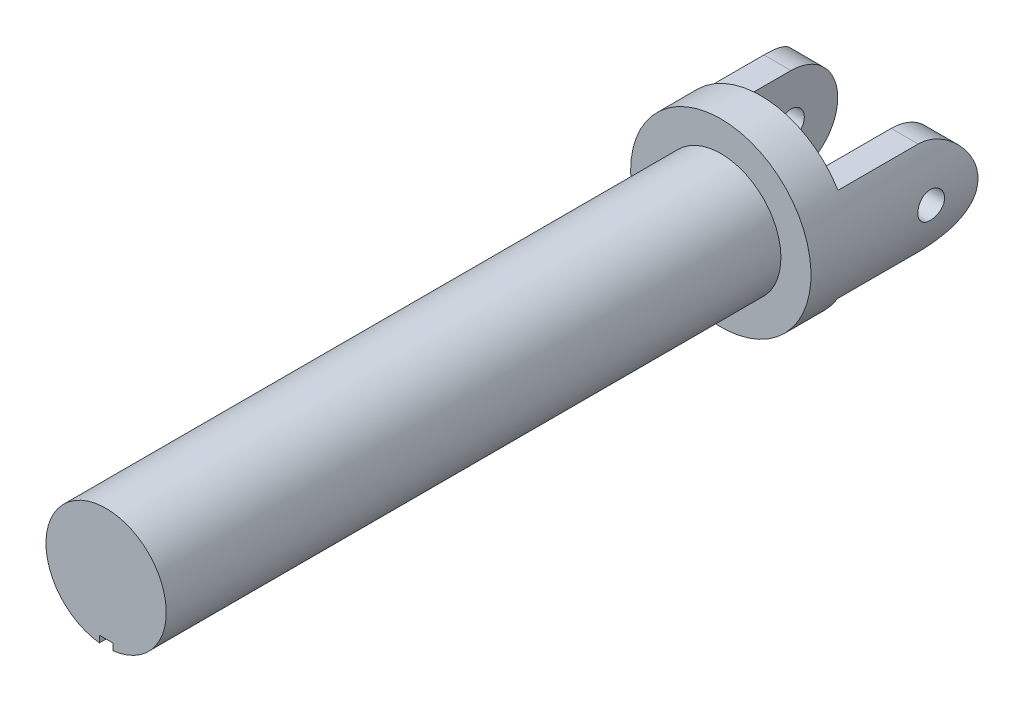
ISO-10303-21;
HEADER;
FILE_DESCRIPTION(('STEP AP214'),'2;1');
FILE_NAME('part.step','',(''),(''),'','','');
FILE_SCHEMA(('AUTOMOTIVE_DESIGN { 1 0 10303 214 1 1 1 1 }'));
ENDSEC;
DATA;
#1=APPLICATION_CONTEXT('core data for automotive mechanical design processes');
#2=APPLICATION_PROTOCOL_DEFINITION('international standard','automotive_design',2000,#1);
#3=PRODUCT_CONTEXT('',#1,'mechanical');
#4=PRODUCT('Part','Part','',(#3));
#5=PRODUCT_RELATED_PRODUCT_CATEGORY('part','',(#4));
#6=PRODUCT_DEFINITION_FORMATION('','',#4);
#7=PRODUCT_DEFINITION_CONTEXT('part definition',#1,'design');
#8=PRODUCT_DEFINITION('design','',#6,#7);
#9=PRODUCT_DEFINITION_SHAPE('','',#8);
#10=(LENGTH_UNIT() NAMED_UNIT(*) SI_UNIT(.MILLI.,.METRE.));
#11=(NAMED_UNIT(*) PLANE_ANGLE_UNIT() SI_UNIT($,.RADIAN.));
#12=(NAMED_UNIT(*) SI_UNIT($,.STERADIAN.) SOLID_ANGLE_UNIT());
#13=UNCERTAINTY_MEASURE_WITH_UNIT(LENGTH_MEASURE(1.E-05),#10,'distance_accuracy_value','');
#14=(GEOMETRIC_REPRESENTATION_CONTEXT(3) GLOBAL_UNCERTAINTY_ASSIGNED_CONTEXT((#13)) GLOBAL_UNIT_ASSIGNED_CONTEXT((#10,
#11,#12)) REPRESENTATION_CONTEXT('',''));
#15=CARTESIAN_POINT('',(0.,0.,0.));
#16=DIRECTION('',(0.,0.,1.));
#17=DIRECTION('',(1.,0.,0.));
#18=AXIS2_PLACEMENT_3D('',#15,#16,#17);
#19=CARTESIAN_POINT('',(0.,0.,23.));
#20=DIRECTION('',(0.,0.,-1.));
#21=DIRECTION('',(-1.,0.,0.));
#22=AXIS2_PLACEMENT_3D('',#19,#20,#21);
#23=CYLINDRICAL_SURFACE('',#22,4.5);
#24=DIRECTION('',(0.,0.,-1.));
#25=VECTOR('',#24,1.);
#26=CARTESIAN_POINT('',(-0.5,-4.47213595499958,23.));
#27=LINE('',#26,#25);
#28=CARTESIAN_POINT('',(-0.5,-4.47213595499958,23.));
#29=VERTEX_POINT('',#28);
#30=CARTESIAN_POINT('',(-0.5,-4.47213595499958,-23.));
#31=VERTEX_POINT('',#30);
#32=EDGE_CURVE('E167',#29,#31,#27,.T.);
#33=ORIENTED_EDGE('',*,*,#32,.F.);
#34=CARTESIAN_POINT('',(0.,0.,23.));
#35=DIRECTION('',(0.,0.,1.));
#36=DIRECTION('',(1.,0.,0.));
#37=AXIS2_PLACEMENT_3D('',#34,#35,#36);
#38=CIRCLE('',#37,4.5);
#39=CARTESIAN_POINT('',(0.5,-4.47213595499958,23.));
#40=VERTEX_POINT('',#39);
#41=EDGE_CURVE('E12',#40,#29,#38,.T.);
#42=ORIENTED_EDGE('',*,*,#41,.F.);
#43=DIRECTION('',(0.,0.,-1.));
#44=VECTOR('',#43,1.);
#45=CARTESIAN_POINT('',(0.5,-4.47213595499958,23.));
#46=LINE('',#45,#44);
#47=CARTESIAN_POINT('',(0.5,-4.47213595499958,-23.));
#48=VERTEX_POINT('',#47);
#49=EDGE_CURVE('E85',#48,#40,#46,.F.);
#50=ORIENTED_EDGE('',*,*,#49,.F.);
#51=CARTESIAN_POINT('',(0.,0.,-23.));
#52=DIRECTION('',(0.,0.,-1.));
#53=DIRECTION('',(-1.,0.,0.));
#54=AXIS2_PLACEMENT_3D('',#51,#52,#53);
#55=CIRCLE('',#54,4.5);
#56=EDGE_CURVE('E78',#31,#48,#55,.T.);
#57=ORIENTED_EDGE('',*,*,#56,.F.);
#58=EDGE_LOOP('',(#33,#42,#50,#57));
#59=FACE_BOUND('',#58,.T.);
#60=ADVANCED_FACE('F70',(#59),#23,.T.);
#61=CARTESIAN_POINT('',(0.,0.,23.));
#62=DIRECTION('',(0.,0.,1.));
#63=DIRECTION('',(1.,0.,0.));
#64=AXIS2_PLACEMENT_3D('',#61,#62,#63);
#65=PLANE('',#64);
#66=ORIENTED_EDGE('',*,*,#41,.T.);
#67=DIRECTION('',(0.,1.,0.));
#68=VECTOR('',#67,1.);
#69=CARTESIAN_POINT('',(-0.5,-4.47213595499958,23.));
#70=LINE('',#69,#68);
#71=CARTESIAN_POINT('',(-0.5,-3.97213595499958,23.));
#72=VERTEX_POINT('',#71);
#73=EDGE_CURVE('E190',#29,#72,#70,.T.);
#74=ORIENTED_EDGE('',*,*,#73,.T.);
#75=DIRECTION('',(1.,0.,0.));
#76=VECTOR('',#75,1.);
#77=CARTESIAN_POINT('',(-0.5,-3.97213595499958,23.));
#78=LINE('',#77,#76);
#79=CARTESIAN_POINT('',(0.5,-3.97213595499958,23.));
#80=VERTEX_POINT('',#79);
#81=EDGE_CURVE('E180',#72,#80,#78,.T.);
#82=ORIENTED_EDGE('',*,*,#81,.T.);
#83=DIRECTION('',(0.,-1.,0.));
#84=VECTOR('',#83,1.);
#85=CARTESIAN_POINT('',(0.5,-3.97213595499958,23.));
#86=LINE('',#85,#84);
#87=EDGE_CURVE('E193',#80,#40,#86,.T.);
#88=ORIENTED_EDGE('',*,*,#87,.T.);
#89=EDGE_LOOP('',(#66,#74,#82,#88));
#90=FACE_BOUND('',#89,.T.);
#91=ADVANCED_FACE('F289',(#90),#65,.T.);
#92=CARTESIAN_POINT('',(0.,0.,-26.));
#93=DIRECTION('',(0.,0.,1.));
#94=DIRECTION('',(1.,0.,0.));
#95=AXIS2_PLACEMENT_3D('',#92,#93,#94);
#96=CYLINDRICAL_SURFACE('',#95,6.75);
#97=CARTESIAN_POINT('',(-6.75,0.,-33.));
#98=CARTESIAN_POINT('',(-6.74999911272059,0.0558425409101658,-32.9999976909739));
#99=CARTESIAN_POINT('',(-6.74929975767196,0.111717684844449,-32.9953066262002));
#100=CARTESIAN_POINT('',(-6.74657719642042,0.221906738606191,-32.9766707451346));
#101=CARTESIAN_POINT('',(-6.74455269374564,0.276219065053058,-32.9627168662834));
#102=CARTESIAN_POINT('',(-6.73940739080019,0.381671836837063,-32.9259809826003));
#103=CARTESIAN_POINT('',(-6.73628741208205,0.432814625447508,-32.9032055921468));
#104=CARTESIAN_POINT('',(-6.72929609307386,0.53054453124302,-32.8494892287142));
#105=CARTESIAN_POINT('',(-6.72542485910577,0.577132291680518,-32.8185494109893));
#106=CARTESIAN_POINT('',(-6.71732864075089,0.664793017751606,-32.7491309350935));
#107=CARTESIAN_POINT('',(-6.71310142384377,0.705826205517568,-32.7106023010483));
#108=CARTESIAN_POINT('',(-6.70478718892022,0.780869855713777,-32.6272074094649));
#109=CARTESIAN_POINT('',(-6.70070017890102,0.814879918107204,-32.5823407911604));
#110=CARTESIAN_POINT('',(-6.69310742202681,0.875066235908758,-32.4872769283577));
#111=CARTESIAN_POINT('',(-6.6896045599627,0.901204098047277,-32.4370551261348));
#112=CARTESIAN_POINT('',(-6.68360711396162,0.944658716040227,-32.3328737482525));
#113=CARTESIAN_POINT('',(-6.68111247643255,0.961975940767676,-32.2789143714423));
#114=CARTESIAN_POINT('',(-6.67743583632494,0.987174376659303,-32.1692074990302));
#115=CARTESIAN_POINT('',(-6.67624437438597,0.99512362030846,-32.1134759525087));
#116=CARTESIAN_POINT('',(-6.67528025275461,1.00157118326889,-32.0014582086667));
#117=CARTESIAN_POINT('',(-6.67550751356993,1.00007003209414,-31.9451720425985));
#118=CARTESIAN_POINT('',(-6.67734650914669,0.987715034694436,-31.834122886774));
#119=CARTESIAN_POINT('',(-6.67894703709383,0.976936892914966,-31.7793512620758));
#120=CARTESIAN_POINT('',(-6.68333472365175,0.946452342629805,-31.6724025809788));
#121=CARTESIAN_POINT('',(-6.68612191507621,0.926745687231395,-31.6202255963716));
#122=CARTESIAN_POINT('',(-6.69258128775432,0.878884561850784,-31.5197165856181));
#123=CARTESIAN_POINT('',(-6.69625682457254,0.850697959155641,-31.4714000851476));
#124=CARTESIAN_POINT('',(-6.70407630948204,0.786699945498339,-31.3801539640613));
#125=CARTESIAN_POINT('',(-6.70822028756469,0.750888046206284,-31.3372246887274));
#126=CARTESIAN_POINT('',(-6.71655927335414,0.672240133725874,-31.2575328147743));
#127=CARTESIAN_POINT('',(-6.7207543845646,0.629339018930786,-31.2208344453194));
#128=CARTESIAN_POINT('',(-6.72868539581363,0.537952544972289,-31.155148804508));
#129=CARTESIAN_POINT('',(-6.73242129392949,0.489467162429427,-31.126161565437));
#130=CARTESIAN_POINT('',(-6.73901671048289,0.388233293631782,-31.0767179850269));
#131=CARTESIAN_POINT('',(-6.74187572726903,0.335482388854874,-31.0562665244811));
#132=CARTESIAN_POINT('',(-6.74639102909035,0.227243041616984,-31.0245304925167));
#133=CARTESIAN_POINT('',(-6.74804739342113,0.171754779898365,-31.0132453167232));
#134=CARTESIAN_POINT('',(-6.74996027662796,0.0601702510974159,-31.000247433234));
#135=CARTESIAN_POINT('',(-6.75022971002842,0.00408448467763606,-30.9984464094182));
#136=CARTESIAN_POINT('',(-6.74937350522533,-0.107588256207565,-31.0042336439311));
#137=CARTESIAN_POINT('',(-6.74824790911938,-0.163175245673514,-31.0118216189294));
#138=CARTESIAN_POINT('',(-6.74473610882736,-0.272005564748212,-31.0360980220436));
#139=CARTESIAN_POINT('',(-6.74235585630278,-0.325258684419557,-31.0527434964207));
#140=CARTESIAN_POINT('',(-6.736600801366,-0.428218204093143,-31.0946171488986));
#141=CARTESIAN_POINT('',(-6.73322595324427,-0.477924440957677,-31.1198457214687));
#142=CARTESIAN_POINT('',(-6.72582473545489,-0.57276805231092,-31.1783771366065));
#143=CARTESIAN_POINT('',(-6.72179390576589,-0.617870444216262,-31.2117360902563));
#144=CARTESIAN_POINT('',(-6.71354345616816,-0.701868155947207,-31.2855031079937));
#145=CARTESIAN_POINT('',(-6.70932382558081,-0.740763124109859,-31.3259115711788));
#146=CARTESIAN_POINT('',(-6.70113048938946,-0.811562616638166,-31.4130234049341));
#147=CARTESIAN_POINT('',(-6.69715905164284,-0.843407990393642,-31.4597750953769));
#148=CARTESIAN_POINT('',(-6.68995170503097,-0.898793373321399,-31.5580159613304));
#149=CARTESIAN_POINT('',(-6.68671577667948,-0.922333602535495,-31.6095050112808));
#150=CARTESIAN_POINT('',(-6.68136217784517,-0.960348470530133,-31.7155814744695));
#151=CARTESIAN_POINT('',(-6.67924064990097,-0.974854414016816,-31.7701574657211));
#152=CARTESIAN_POINT('',(-6.67634573947977,-0.994488675177334,-31.8810047537763));
#153=CARTESIAN_POINT('',(-6.67557226638415,-0.99961762319039,-31.9372759363674));
#154=CARTESIAN_POINT('',(-6.67546436730879,-1.00033757943702,-32.0493267995347));
#155=CARTESIAN_POINT('',(-6.67611591022978,-0.996021584936611,-32.1051058913773));
#156=CARTESIAN_POINT('',(-6.67875416313144,-0.978173271070791,-32.2151356901121));
#157=CARTESIAN_POINT('',(-6.68074087117957,-0.96464096504521,-32.2693863992164));
#158=CARTESIAN_POINT('',(-6.6858207421393,-0.928776749344399,-32.3747947554377));
#159=CARTESIAN_POINT('',(-6.68891310765919,-0.906451180127702,-32.4259546006592));
#160=CARTESIAN_POINT('',(-6.69585685750153,-0.853643415012494,-32.5238174857813));
#161=CARTESIAN_POINT('',(-6.69970826624953,-0.823160956618993,-32.5705203821881));
#162=CARTESIAN_POINT('',(-6.70778131838235,-0.754566231345787,-32.658616385123));
#163=CARTESIAN_POINT('',(-6.7120060970762,-0.716385046344518,-32.6999555482106));
#164=CARTESIAN_POINT('',(-6.72032356595988,-0.633622295064071,-32.7756731917375));
#165=CARTESIAN_POINT('',(-6.72441622518943,-0.589039241744761,-32.810050050473));
#166=CARTESIAN_POINT('',(-6.73203333976492,-0.494457481821438,-32.8710314318147));
#167=CARTESIAN_POINT('',(-6.73555463068598,-0.444431017911154,-32.897593290153));
#168=CARTESIAN_POINT('',(-6.74160116950649,-0.340598638239509,-32.9418980659903));
#169=CARTESIAN_POINT('',(-6.74412745252673,-0.286796719176188,-32.9596501534456));
#170=CARTESIAN_POINT('',(-6.7473200627825,-0.193958660761499,-32.9817862974269));
#171=CARTESIAN_POINT('',(-6.74831989929762,-0.155496645397277,-32.9886060480908));
#172=CARTESIAN_POINT('',(-6.74966017396957,-0.0780283890929512,-32.9977136790094));
#173=CARTESIAN_POINT('',(-6.75000062002111,-0.0390221546742598,-33.0000016135221));
#174=CARTESIAN_POINT('',(-6.75,0.,-33.));
#175=B_SPLINE_CURVE_WITH_KNOTS('',3,(#97,#98,#99,#100,#101,#102,#103,#104,#105,#106,#107,#108,
#109,#110,#111,#112,#113,#114,#115,#116,#117,#118,#119,#120,#121,#122,#123,#124,#125,#126,#127,
#128,#129,#130,#131,#132,#133,#134,#135,#136,#137,#138,#139,#140,#141,#142,#143,#144,#145,#146,
#147,#148,#149,#150,#151,#152,#153,#154,#155,#156,#157,#158,#159,#160,#161,#162,#163,#164,#165,
#166,#167,#168,#169,#170,#171,#172,#173,#174),.UNSPECIFIED.,.T.,.F.,(4,2,2,2,2,2,2,2,2,2,2,2,2,
2,2,2,2,2,2,2,2,2,2,2,2,2,2,2,2,2,2,2,2,2,2,2,2,2,4),(0.,0.167385036095,0.334934080339169,
0.502357738579201,0.669757719315224,0.838299369512635,1.00685061718638,1.17621106378314,
1.34556250685452,1.51367634882373,1.68178077130973,1.84852625275945,2.01527634536395,
2.18266643054018,2.35006723873285,2.51910075696945,2.68813498291829,2.85726573135217,
3.02638532731911,3.19392726588315,3.36146414868353,3.52821335257177,3.69497022109768,
3.86291226368385,4.03086381714737,4.20017525181087,4.36948220029191,4.53819917064465,
4.70690479910915,4.87395678992065,5.04100853893915,5.20794005372037,5.37487694113275,
5.54338046523497,5.71192319321395,5.8813696603633,6.050639381387,6.16760760787004,
6.28457443391693),.UNSPECIFIED.);
#176=CARTESIAN_POINT('',(-6.75,0.,-33.));
#177=VERTEX_POINT('',#176);
#178=EDGE_CURVE('E208',#177,#177,#175,.T.);
#179=ORIENTED_EDGE('',*,*,#178,.T.);
#180=EDGE_LOOP('',(#179));
#181=FACE_BOUND('',#180,.T.);
#182=CARTESIAN_POINT('',(6.75,0.,-33.));
#183=CARTESIAN_POINT('',(6.74999911272059,-0.0558425409101658,-32.9999976909739));
#184=CARTESIAN_POINT('',(6.74929975767196,-0.111717684844449,-32.9953066262002));
#185=CARTESIAN_POINT('',(6.74657719642042,-0.221906738606191,-32.9766707451346));
#186=CARTESIAN_POINT('',(6.74455269374564,-0.276219065053058,-32.9627168662834));
#187=CARTESIAN_POINT('',(6.73940739080019,-0.381671836837063,-32.9259809826003));
#188=CARTESIAN_POINT('',(6.73628741208205,-0.432814625447508,-32.9032055921468));
#189=CARTESIAN_POINT('',(6.72929609307386,-0.53054453124302,-32.8494892287142));
#190=CARTESIAN_POINT('',(6.72542485910577,-0.577132291680518,-32.8185494109893));
#191=CARTESIAN_POINT('',(6.71732864075089,-0.664793017751606,-32.7491309350935));
#192=CARTESIAN_POINT('',(6.71310142384377,-0.705826205517568,-32.7106023010483));
#193=CARTESIAN_POINT('',(6.70478718892022,-0.780869855713777,-32.6272074094649));
#194=CARTESIAN_POINT('',(6.70070017890102,-0.814879918107204,-32.5823407911604));
#195=CARTESIAN_POINT('',(6.69310742202681,-0.875066235908758,-32.4872769283577));
#196=CARTESIAN_POINT('',(6.6896045599627,-0.901204098047277,-32.4370551261348));
#197=CARTESIAN_POINT('',(6.68360711396162,-0.944658716040227,-32.3328737482525));
#198=CARTESIAN_POINT('',(6.68111247643255,-0.961975940767676,-32.2789143714423));
#199=CARTESIAN_POINT('',(6.67743583632494,-0.987174376659303,-32.1692074990302));
#200=CARTESIAN_POINT('',(6.67624437438597,-0.99512362030846,-32.1134759525087));
#201=CARTESIAN_POINT('',(6.67528025275461,-1.00157118326889,-32.0014582086667));
#202=CARTESIAN_POINT('',(6.67550751356993,-1.00007003209414,-31.9451720425985));
#203=CARTESIAN_POINT('',(6.67734650914669,-0.987715034694436,-31.834122886774));
#204=CARTESIAN_POINT('',(6.67894703709383,-0.976936892914966,-31.7793512620758));
#205=CARTESIAN_POINT('',(6.68333472365175,-0.946452342629805,-31.6724025809788));
#206=CARTESIAN_POINT('',(6.68612191507621,-0.926745687231395,-31.6202255963716));
#207=CARTESIAN_POINT('',(6.69258128775432,-0.878884561850784,-31.5197165856181));
#208=CARTESIAN_POINT('',(6.69625682457254,-0.850697959155641,-31.4714000851476));
#209=CARTESIAN_POINT('',(6.70407630948204,-0.786699945498339,-31.3801539640613));
#210=CARTESIAN_POINT('',(6.70822028756469,-0.750888046206284,-31.3372246887274));
#211=CARTESIAN_POINT('',(6.71655927335414,-0.672240133725874,-31.2575328147743));
#212=CARTESIAN_POINT('',(6.7207543845646,-0.629339018930786,-31.2208344453194));
#213=CARTESIAN_POINT('',(6.72868539581363,-0.537952544972289,-31.155148804508));
#214=CARTESIAN_POINT('',(6.73242129392949,-0.489467162429427,-31.126161565437));
#215=CARTESIAN_POINT('',(6.73901671048289,-0.388233293631782,-31.0767179850269));
#216=CARTESIAN_POINT('',(6.74187572726903,-0.335482388854874,-31.0562665244811));
#217=CARTESIAN_POINT('',(6.74639102909035,-0.227243041616984,-31.0245304925167));
#218=CARTESIAN_POINT('',(6.74804739342113,-0.171754779898365,-31.0132453167232));
#219=CARTESIAN_POINT('',(6.74996027662796,-0.0601702510974159,-31.000247433234));
#220=CARTESIAN_POINT('',(6.75022971002842,-0.00408448467763606,-30.9984464094182));
#221=CARTESIAN_POINT('',(6.74937350522533,0.107588256207565,-31.0042336439311));
#222=CARTESIAN_POINT('',(6.74824790911938,0.163175245673514,-31.0118216189294));
#223=CARTESIAN_POINT('',(6.74473610882736,0.272005564748212,-31.0360980220436));
#224=CARTESIAN_POINT('',(6.74235585630278,0.325258684419557,-31.0527434964207));
#225=CARTESIAN_POINT('',(6.736600801366,0.428218204093143,-31.0946171488986));
#226=CARTESIAN_POINT('',(6.73322595324427,0.477924440957677,-31.1198457214687));
#227=CARTESIAN_POINT('',(6.72582473545489,0.57276805231092,-31.1783771366065));
#228=CARTESIAN_POINT('',(6.72179390576589,0.617870444216262,-31.2117360902563));
#229=CARTESIAN_POINT('',(6.71354345616816,0.701868155947207,-31.2855031079937));
#230=CARTESIAN_POINT('',(6.70932382558081,0.740763124109859,-31.3259115711788));
#231=CARTESIAN_POINT('',(6.70113048938946,0.811562616638166,-31.4130234049341));
#232=CARTESIAN_POINT('',(6.69715905164284,0.843407990393642,-31.4597750953769));
#233=CARTESIAN_POINT('',(6.68995170503097,0.898793373321399,-31.5580159613304));
#234=CARTESIAN_POINT('',(6.68671577667948,0.922333602535495,-31.6095050112808));
#235=CARTESIAN_POINT('',(6.68136217784517,0.960348470530133,-31.7155814744695));
#236=CARTESIAN_POINT('',(6.67924064990097,0.974854414016816,-31.7701574657211));
#237=CARTESIAN_POINT('',(6.67634573947977,0.994488675177334,-31.8810047537763));
#238=CARTESIAN_POINT('',(6.67557226638415,0.99961762319039,-31.9372759363674));
#239=CARTESIAN_POINT('',(6.67546436730879,1.00033757943702,-32.0493267995347));
#240=CARTESIAN_POINT('',(6.67611591022978,0.996021584936611,-32.1051058913773));
#241=CARTESIAN_POINT('',(6.67875416313144,0.978173271070791,-32.2151356901121));
#242=CARTESIAN_POINT('',(6.68074087117957,0.96464096504521,-32.2693863992164));
#243=CARTESIAN_POINT('',(6.6858207421393,0.928776749344399,-32.3747947554377));
#244=CARTESIAN_POINT('',(6.68891310765919,0.906451180127702,-32.4259546006592));
#245=CARTESIAN_POINT('',(6.69585685750153,0.853643415012494,-32.5238174857813));
#246=CARTESIAN_POINT('',(6.69970826624953,0.823160956618993,-32.5705203821881));
#247=CARTESIAN_POINT('',(6.70778131838235,0.754566231345787,-32.658616385123));
#248=CARTESIAN_POINT('',(6.7120060970762,0.716385046344518,-32.6999555482106));
#249=CARTESIAN_POINT('',(6.72032356595988,0.633622295064071,-32.7756731917375));
#250=CARTESIAN_POINT('',(6.72441622518943,0.589039241744761,-32.810050050473));
#251=CARTESIAN_POINT('',(6.73203333976492,0.494457481821438,-32.8710314318147));
#252=CARTESIAN_POINT('',(6.73555463068598,0.444431017911154,-32.897593290153));
#253=CARTESIAN_POINT('',(6.74160116950649,0.340598638239509,-32.9418980659903));
#254=CARTESIAN_POINT('',(6.74412745252673,0.286796719176188,-32.9596501534456));
#255=CARTESIAN_POINT('',(6.7473200627825,0.193958660761499,-32.9817862974269));
#256=CARTESIAN_POINT('',(6.74831989929762,0.155496645397277,-32.9886060480908));
#257=CARTESIAN_POINT('',(6.74966017396957,0.0780283890929512,-32.9977136790094));
#258=CARTESIAN_POINT('',(6.75000062002111,0.0390221546742598,-33.0000016135221));
#259=CARTESIAN_POINT('',(6.75,0.,-33.));
#260=B_SPLINE_CURVE_WITH_KNOTS('',3,(#182,#183,#184,#185,#186,#187,#188,#189,#190,#191,#192,
#193,#194,#195,#196,#197,#198,#199,#200,#201,#202,#203,#204,#205,#206,#207,#208,#209,#210,#211,
#212,#213,#214,#215,#216,#217,#218,#219,#220,#221,#222,#223,#224,#225,#226,#227,#228,#229,#230,
#231,#232,#233,#234,#235,#236,#237,#238,#239,#240,#241,#242,#243,#244,#245,#246,#247,#248,#249,
#250,#251,#252,#253,#254,#255,#256,#257,#258,#259),.UNSPECIFIED.,.T.,.F.,(4,2,2,2,2,2,2,2,2,2,2,
2,2,2,2,2,2,2,2,2,2,2,2,2,2,2,2,2,2,2,2,2,2,2,2,2,2,2,4),(0.,0.167385036095,0.334934080339169,
0.502357738579201,0.669757719315224,0.838299369512635,1.00685061718638,1.17621106378314,
1.34556250685452,1.51367634882373,1.68178077130973,1.84852625275945,2.01527634536395,
2.18266643054018,2.35006723873285,2.51910075696945,2.68813498291829,2.85726573135217,
3.02638532731911,3.19392726588315,3.36146414868353,3.52821335257177,3.69497022109768,
3.86291226368385,4.03086381714737,4.20017525181087,4.36948220029191,4.53819917064465,
4.70690479910915,4.87395678992065,5.04100853893915,5.20794005372037,5.37487694113275,
5.54338046523497,5.71192319321395,5.8813696603633,6.050639381387,6.16760760787004,
6.28457443391693),.UNSPECIFIED.);
#261=CARTESIAN_POINT('',(6.75,0.,-33.));
#262=VERTEX_POINT('',#261);
#263=EDGE_CURVE('E200',#262,#262,#260,.T.);
#264=ORIENTED_EDGE('',*,*,#263,.T.);
#265=EDGE_LOOP('',(#264));
#266=FACE_BOUND('',#265,.T.);
#267=CARTESIAN_POINT('',(0.,0.,-23.));
#268=DIRECTION('',(0.,0.,-1.));
#269=DIRECTION('',(-1.,0.,0.));
#270=AXIS2_PLACEMENT_3D('',#267,#268,#269);
#271=CIRCLE('',#270,6.75);
#272=CARTESIAN_POINT('',(-6.75,0.,-23.));
#273=VERTEX_POINT('',#272);
#274=EDGE_CURVE('E279',#273,#273,#271,.T.);
#275=ORIENTED_EDGE('',*,*,#274,.T.);
#276=EDGE_LOOP('',(#275));
#277=FACE_BOUND('',#276,.T.);
#278=DIRECTION('',(0.,0.,1.));
#279=VECTOR('',#278,1.);
#280=CARTESIAN_POINT('',(5.7716981903076,-3.5,-35.5));
#281=LINE('',#280,#279);
#282=CARTESIAN_POINT('',(5.7716981903076,-3.5,-32.));
#283=VERTEX_POINT('',#282);
#284=CARTESIAN_POINT('',(5.7716981903076,-3.5,-26.));
#285=VERTEX_POINT('',#284);
#286=EDGE_CURVE('E277',#283,#285,#281,.T.);
#287=ORIENTED_EDGE('',*,*,#286,.F.);
#288=CARTESIAN_POINT('',(5.7716981903076,3.5,-32.));
#289=CARTESIAN_POINT('',(5.77166955421002,3.50001705554504,-32.0911296720305));
#290=CARTESIAN_POINT('',(5.77385573039002,3.49644148706506,-32.1822433063665));
#291=CARTESIAN_POINT('',(5.78244171296421,3.4822395721349,-32.3636602749526));
#292=CARTESIAN_POINT('',(5.78883869884604,3.47161794528503,-32.4539641106151));
#293=CARTESIAN_POINT('',(5.8055794457996,3.44354424311248,-32.6325588453453));
#294=CARTESIAN_POINT('',(5.81589880800477,3.4261343766198,-32.7208586824379));
#295=CARTESIAN_POINT('',(5.8400971794397,3.38472148424651,-32.8953846300326));
#296=CARTESIAN_POINT('',(5.85397664340042,3.36071761608779,-32.981610474084));
#297=CARTESIAN_POINT('',(5.90020187745128,3.27933331417958,-33.235939769041));
#298=CARTESIAN_POINT('',(5.93719387256823,3.21248677463199,-33.4002758228421));
#299=CARTESIAN_POINT('',(6.01931780913164,3.05583264232749,-33.7155181456972));
#300=CARTESIAN_POINT('',(6.06446323301233,2.96598691404089,-33.8664015428341));
#301=CARTESIAN_POINT('',(6.16264056776468,2.75660193180785,-34.1650012631881));
#302=CARTESIAN_POINT('',(6.21601685999561,2.63514101237681,-34.3112609853852));
#303=CARTESIAN_POINT('',(6.32186227552666,2.37001501026079,-34.5824506155107));
#304=CARTESIAN_POINT('',(6.37433103978394,2.22634135335382,-34.7073722474757));
#305=CARTESIAN_POINT('',(6.47713032509301,1.90767178791382,-34.9415319664244));
#306=CARTESIAN_POINT('',(6.52701273178548,1.7311421973441,-35.0489165521625));
#307=CARTESIAN_POINT('',(6.59252243494399,1.45268714248444,-35.1859746896809));
#308=CARTESIAN_POINT('',(6.61280630524951,1.35759448846738,-35.2276568912017));
#309=CARTESIAN_POINT('',(6.64970570263882,1.16347180275601,-35.3025976795009));
#310=CARTESIAN_POINT('',(6.66632220054168,1.06444282128918,-35.3358584959144));
#311=CARTESIAN_POINT('',(6.70325793796902,0.808346178347386,-35.4092047876708));
#312=CARTESIAN_POINT('',(6.72066792574392,0.649032894259849,-35.4431472978045));
#313=CARTESIAN_POINT('',(6.74403968155987,0.326492109055728,-35.4885444837744));
#314=CARTESIAN_POINT('',(6.75000510269833,0.163265873799954,-35.5000063354468));
#315=CARTESIAN_POINT('',(6.74999426917082,-0.183363540953696,-35.4999928846737));
#316=CARTESIAN_POINT('',(6.74245762627459,-0.366777079930823,-35.4855203872262));
#317=CARTESIAN_POINT('',(6.71307969249925,-0.727990267216298,-35.4283413782657));
#318=CARTESIAN_POINT('',(6.6912304660912,-0.905786743819562,-35.3856192037591));
#319=CARTESIAN_POINT('',(6.63549697804145,-1.2502132149756,-35.2740853297312));
#320=CARTESIAN_POINT('',(6.60165505000524,-1.41688006807026,-35.2053653441941));
#321=CARTESIAN_POINT('',(6.52498977679903,-1.73608609268259,-35.0443390011145));
#322=CARTESIAN_POINT('',(6.482164616279,-1.88862239967496,-34.9520278754017));
#323=CARTESIAN_POINT('',(6.38822453662088,-2.18607698720936,-34.739804038613));
#324=CARTESIAN_POINT('',(6.33675608268062,-2.32989818981952,-34.6185118676454));
#325=CARTESIAN_POINT('',(6.23239813645146,-2.59619176957678,-34.3547805876641));
#326=CARTESIAN_POINT('',(6.17950732609221,-2.7186434979309,-34.2123212687008));
#327=CARTESIAN_POINT('',(6.07301991608375,-2.94930903512128,-33.8955441184375));
#328=CARTESIAN_POINT('',(6.01975168260832,-3.05540163910414,-33.7195419513625));
#329=CARTESIAN_POINT('',(5.94847215092401,-3.19073390424003,-33.4421572873763));
#330=CARTESIAN_POINT('',(5.92615721445445,-3.23186426667084,-33.3475092158008));
#331=CARTESIAN_POINT('',(5.88523085987807,-3.305804412711,-33.1542678064187));
#332=CARTESIAN_POINT('',(5.86661687095029,-3.33861997647864,-33.0556772647871));
#333=CARTESIAN_POINT('',(5.83770575121213,-3.38885286422883,-32.8786689773138));
#334=CARTESIAN_POINT('',(5.82648140039545,-3.40807647409248,-32.8009085732122));
#335=CARTESIAN_POINT('',(5.80698300904305,-3.44119398640323,-32.643907733566));
#336=CARTESIAN_POINT('',(5.79870821336479,-3.45508925307723,-32.5646676823145));
#337=CARTESIAN_POINT('',(5.7853283424933,-3.47744975957481,-32.4048182151242));
#338=CARTESIAN_POINT('',(5.78023664157441,-3.48589209290093,-32.3242044640658));
#339=CARTESIAN_POINT('',(5.77341130360068,-3.49717450838589,-32.1623968818765));
#340=CARTESIAN_POINT('',(5.77167969418554,-3.50001120785646,-32.0812027301436));
#341=CARTESIAN_POINT('',(5.7716981903076,-3.5,-32.));
#342=B_SPLINE_CURVE_WITH_KNOTS('',3,(#288,#289,#290,#291,#292,#293,#294,#295,#296,#297,#298,
#299,#300,#301,#302,#303,#304,#305,#306,#307,#308,#309,#310,#311,#312,#313,#314,#315,#316,#317,
#318,#319,#320,#321,#322,#323,#324,#325,#326,#327,#328,#329,#330,#331,#332,#333,#334,#335,#336,
#337,#338,#339,#340,#341),.UNSPECIFIED.,.F.,.F.,(4,2,2,2,2,2,2,2,2,2,2,2,2,2,2,2,2,2,2,2,2,2,2,
2,2,2,4),(0.,0.27326645746963,0.54635005980307,0.817762050779349,1.08920872642422,
1.63035056553494,2.17239556411607,2.76231271942996,3.35245815672481,3.9864270169589,
4.30339604861505,4.62028107199126,5.10968645463685,5.59893559342908,6.14841021668935,
6.69818975112102,7.24604761353161,7.79401629502241,8.37674582580403,8.96003535292281,
9.59334043484272,9.90972008307292,10.2258791880275,10.4683092152784,10.7106771311512,
10.9540566679023,11.1975830258738),.UNSPECIFIED.);
#343=CARTESIAN_POINT('',(5.7716981903076,3.5,-32.));
#344=VERTEX_POINT('',#343);
#345=EDGE_CURVE('E242',#344,#283,#342,.T.);
#346=ORIENTED_EDGE('',*,*,#345,.F.);
#347=DIRECTION('',(0.,0.,1.));
#348=VECTOR('',#347,1.);
#349=CARTESIAN_POINT('',(5.7716981903076,3.5,-35.5));
#350=LINE('',#349,#348);
#351=CARTESIAN_POINT('',(5.7716981903076,3.5,-26.));
#352=VERTEX_POINT('',#351);
#353=EDGE_CURVE('E271',#344,#352,#350,.T.);
#354=ORIENTED_EDGE('',*,*,#353,.T.);
#355=CARTESIAN_POINT('',(0.,0.,-26.));
#356=DIRECTION('',(0.,0.,-1.));
#357=DIRECTION('',(-1.,0.,0.));
#358=AXIS2_PLACEMENT_3D('',#355,#356,#357);
#359=CIRCLE('',#358,6.75);
#360=CARTESIAN_POINT('',(-5.7716981903076,3.5,-26.));
#361=VERTEX_POINT('',#360);
#362=EDGE_CURVE('E283',#361,#352,#359,.T.);
#363=ORIENTED_EDGE('',*,*,#362,.F.);
#364=DIRECTION('',(0.,0.,1.));
#365=VECTOR('',#364,1.);
#366=CARTESIAN_POINT('',(-5.7716981903076,3.5,-35.5));
#367=LINE('',#366,#365);
#368=CARTESIAN_POINT('',(-5.7716981903076,3.5,-32.));
#369=VERTEX_POINT('',#368);
#370=EDGE_CURVE('E260',#369,#361,#367,.T.);
#371=ORIENTED_EDGE('',*,*,#370,.F.);
#372=CARTESIAN_POINT('',(-5.7716981903076,-3.5,-32.));
#373=CARTESIAN_POINT('',(-5.77166955421002,-3.50001705554504,-32.0911296720305));
#374=CARTESIAN_POINT('',(-5.77385573039002,-3.49644148706506,-32.1822433063665));
#375=CARTESIAN_POINT('',(-5.78244171296421,-3.4822395721349,-32.3636602749527));
#376=CARTESIAN_POINT('',(-5.78883869884604,-3.47161794528503,-32.4539641106151));
#377=CARTESIAN_POINT('',(-5.8055794457996,-3.44354424311248,-32.6325588453453));
#378=CARTESIAN_POINT('',(-5.81589880800477,-3.4261343766198,-32.7208586824379));
#379=CARTESIAN_POINT('',(-5.8400971794397,-3.38472148424651,-32.8953846300326));
#380=CARTESIAN_POINT('',(-5.85397664340042,-3.36071761608778,-32.981610474084));
#381=CARTESIAN_POINT('',(-5.90020187745128,-3.27933331417957,-33.235939769041));
#382=CARTESIAN_POINT('',(-5.93719387256824,-3.21248677463199,-33.4002758228421));
#383=CARTESIAN_POINT('',(-6.01931780913164,-3.05583264232749,-33.7155181456973));
#384=CARTESIAN_POINT('',(-6.06446323301233,-2.96598691404088,-33.8664015428341));
#385=CARTESIAN_POINT('',(-6.16264056776469,-2.75660193180785,-34.1650012631881));
#386=CARTESIAN_POINT('',(-6.21601685999561,-2.63514101237681,-34.3112609853852));
#387=CARTESIAN_POINT('',(-6.32186227552666,-2.37001501026079,-34.5824506155107));
#388=CARTESIAN_POINT('',(-6.37433103978394,-2.22634135335381,-34.7073722474757));
#389=CARTESIAN_POINT('',(-6.47713032509302,-1.90767178791381,-34.9415319664244));
#390=CARTESIAN_POINT('',(-6.52701273178548,-1.73114219734409,-35.0489165521625));
#391=CARTESIAN_POINT('',(-6.59252243494399,-1.45268714248444,-35.1859746896809));
#392=CARTESIAN_POINT('',(-6.61280630524951,-1.35759448846738,-35.2276568912017));
#393=CARTESIAN_POINT('',(-6.64970570263882,-1.163471802756,-35.3025976795009));
#394=CARTESIAN_POINT('',(-6.66632220054169,-1.06444282128917,-35.3358584959144));
#395=CARTESIAN_POINT('',(-6.70325793796902,-0.808346178347381,-35.4092047876708));
#396=CARTESIAN_POINT('',(-6.72066792574392,-0.649032894259845,-35.4431472978045));
#397=CARTESIAN_POINT('',(-6.74403968155987,-0.326492109055726,-35.4885444837744));
#398=CARTESIAN_POINT('',(-6.75000510269833,-0.163265873799953,-35.5000063354468));
#399=CARTESIAN_POINT('',(-6.74999426917082,0.183363540953696,-35.4999928846737));
#400=CARTESIAN_POINT('',(-6.74245762627459,0.366777079930822,-35.4855203872262));
#401=CARTESIAN_POINT('',(-6.71307969249925,0.727990267216298,-35.4283413782657));
#402=CARTESIAN_POINT('',(-6.6912304660912,0.905786743819563,-35.3856192037591));
#403=CARTESIAN_POINT('',(-6.63549697804145,1.2502132149756,-35.2740853297312));
#404=CARTESIAN_POINT('',(-6.60165505000524,1.41688006807026,-35.2053653441941));
#405=CARTESIAN_POINT('',(-6.52498977679902,1.7360860926826,-35.0443390011145));
#406=CARTESIAN_POINT('',(-6.482164616279,1.88862239967496,-34.9520278754017));
#407=CARTESIAN_POINT('',(-6.38822453662088,2.18607698720936,-34.739804038613));
#408=CARTESIAN_POINT('',(-6.33675608268062,2.32989818981952,-34.6185118676454));
#409=CARTESIAN_POINT('',(-6.23239813645146,2.59619176957678,-34.3547805876641));
#410=CARTESIAN_POINT('',(-6.17950732609221,2.71864349793091,-34.2123212687008));
#411=CARTESIAN_POINT('',(-6.07301991608375,2.94930903512128,-33.8955441184375));
#412=CARTESIAN_POINT('',(-6.01975168260832,3.05540163910414,-33.7195419513625));
#413=CARTESIAN_POINT('',(-5.94847215092401,3.19073390424003,-33.4421572873763));
#414=CARTESIAN_POINT('',(-5.92615721445445,3.23186426667084,-33.3475092158008));
#415=CARTESIAN_POINT('',(-5.88523085987807,3.305804412711,-33.1542678064187));
#416=CARTESIAN_POINT('',(-5.86661687095029,3.33861997647864,-33.0556772647871));
#417=CARTESIAN_POINT('',(-5.83770575121213,3.38885286422883,-32.8786689773138));
#418=CARTESIAN_POINT('',(-5.82648140039545,3.40807647409248,-32.8009085732122));
#419=CARTESIAN_POINT('',(-5.80698300904305,3.44119398640323,-32.643907733566));
#420=CARTESIAN_POINT('',(-5.7987082133648,3.45508925307723,-32.5646676823145));
#421=CARTESIAN_POINT('',(-5.7853283424933,3.47744975957481,-32.4048182151242));
#422=CARTESIAN_POINT('',(-5.78023664157441,3.48589209290093,-32.3242044640658));
#423=CARTESIAN_POINT('',(-5.77341130360068,3.49717450838589,-32.1623968818766));
#424=CARTESIAN_POINT('',(-5.77167969418554,3.50001120785646,-32.0812027301436));
#425=CARTESIAN_POINT('',(-5.7716981903076,3.5,-32.));
#426=B_SPLINE_CURVE_WITH_KNOTS('',3,(#372,#373,#374,#375,#376,#377,#378,#379,#380,#381,#382,
#383,#384,#385,#386,#387,#388,#389,#390,#391,#392,#393,#394,#395,#396,#397,#398,#399,#400,#401,
#402,#403,#404,#405,#406,#407,#408,#409,#410,#411,#412,#413,#414,#415,#416,#417,#418,#419,#420,
#421,#422,#423,#424,#425),.UNSPECIFIED.,.F.,.F.,(4,2,2,2,2,2,2,2,2,2,2,2,2,2,2,2,2,2,2,2,2,2,2,
2,2,2,4),(0.,0.273266457469637,0.546350059803077,0.817762050779356,1.08920872642422,
1.63035056553494,2.17239556411608,2.76231271942997,3.35245815672481,3.98642701695891,
4.30339604861506,4.62028107199127,5.10968645463685,5.59893559342907,6.14841021668935,
6.69818975112102,7.24604761353162,7.79401629502241,8.37674582580403,8.96003535292282,
9.59334043484273,9.90972008307293,10.2258791880275,10.4683092152784,10.7106771311512,
10.9540566679023,11.1975830258738),.UNSPECIFIED.);
#427=CARTESIAN_POINT('',(-5.7716981903076,-3.5,-32.));
#428=VERTEX_POINT('',#427);
#429=EDGE_CURVE('E235',#428,#369,#426,.T.);
#430=ORIENTED_EDGE('',*,*,#429,.F.);
#431=DIRECTION('',(0.,0.,1.));
#432=VECTOR('',#431,1.);
#433=CARTESIAN_POINT('',(-5.7716981903076,-3.5,-35.5));
#434=LINE('',#433,#432);
#435=CARTESIAN_POINT('',(-5.7716981903076,-3.5,-26.));
#436=VERTEX_POINT('',#435);
#437=EDGE_CURVE('E255',#428,#436,#434,.T.);
#438=ORIENTED_EDGE('',*,*,#437,.T.);
#439=EDGE_CURVE('E280',#285,#436,#359,.T.);
#440=ORIENTED_EDGE('',*,*,#439,.F.);
#441=EDGE_LOOP('',(#287,#346,#354,#363,#371,#430,#438,#440));
#442=FACE_BOUND('',#441,.T.);
#443=ADVANCED_FACE('F213',(#181,#266,#277,#442),#96,.T.);
#444=CARTESIAN_POINT('',(3.75,3.5,-35.5));
#445=DIRECTION('',(1.,0.,0.));
#446=DIRECTION('',(0.,0.,-1.));
#447=AXIS2_PLACEMENT_3D('',#444,#445,#446);
#448=PLANE('',#447);
#449=CARTESIAN_POINT('',(3.75,0.,-32.));
#450=DIRECTION('',(1.,0.,0.));
#451=DIRECTION('',(0.,0.,-1.));
#452=AXIS2_PLACEMENT_3D('',#449,#450,#451);
#453=CIRCLE('',#452,0.999999999999998);
#454=CARTESIAN_POINT('',(3.75,0.,-33.));
#455=VERTEX_POINT('',#454);
#456=EDGE_CURVE('E197',#455,#455,#453,.T.);
#457=ORIENTED_EDGE('',*,*,#456,.T.);
#458=EDGE_LOOP('',(#457));
#459=FACE_BOUND('',#458,.T.);
#460=CARTESIAN_POINT('',(3.75,0.,-32.));
#461=DIRECTION('',(1.,0.,0.));
#462=DIRECTION('',(0.,0.,-1.));
#463=AXIS2_PLACEMENT_3D('',#460,#461,#462);
#464=CIRCLE('',#463,3.5);
#465=CARTESIAN_POINT('',(3.75,-3.5,-32.));
#466=VERTEX_POINT('',#465);
#467=CARTESIAN_POINT('',(3.75,3.5,-32.));
#468=VERTEX_POINT('',#467);
#469=EDGE_CURVE('E339',#466,#468,#464,.T.);
#470=ORIENTED_EDGE('',*,*,#469,.F.);
#471=DIRECTION('',(0.,0.,1.));
#472=VECTOR('',#471,1.);
#473=CARTESIAN_POINT('',(3.75,-3.5,-35.5));
#474=LINE('',#473,#472);
#475=CARTESIAN_POINT('',(3.75,-3.5,-26.));
#476=VERTEX_POINT('',#475);
#477=EDGE_CURVE('E275',#466,#476,#474,.T.);
#478=ORIENTED_EDGE('',*,*,#477,.T.);
#479=DIRECTION('',(0.,1.,0.));
#480=VECTOR('',#479,1.);
#481=CARTESIAN_POINT('',(3.75,3.5,-26.));
#482=LINE('',#481,#480);
#483=CARTESIAN_POINT('',(3.75,3.5,-26.));
#484=VERTEX_POINT('',#483);
#485=EDGE_CURVE('E265',#476,#484,#482,.T.);
#486=ORIENTED_EDGE('',*,*,#485,.T.);
#487=DIRECTION('',(0.,0.,1.));
#488=VECTOR('',#487,1.);
#489=CARTESIAN_POINT('',(3.75,3.5,-35.5));
#490=LINE('',#489,#488);
#491=EDGE_CURVE('E273',#468,#484,#490,.T.);
#492=ORIENTED_EDGE('',*,*,#491,.F.);
#493=EDGE_LOOP('',(#470,#478,#486,#492));
#494=FACE_BOUND('',#493,.T.);
#495=ADVANCED_FACE('F304',(#459,#494),#448,.F.);
#496=CARTESIAN_POINT('',(-3.75,-3.5,-35.5));
#497=DIRECTION('',(-1.,0.,0.));
#498=DIRECTION('',(0.,-1.,0.));
#499=AXIS2_PLACEMENT_3D('',#496,#497,#498);
#500=PLANE('',#499);
#501=CARTESIAN_POINT('',(-3.75,0.,-32.));
#502=DIRECTION('',(-1.,0.,0.));
#503=DIRECTION('',(0.,-1.,0.));
#504=AXIS2_PLACEMENT_3D('',#501,#502,#503);
#505=CIRCLE('',#504,0.999999999999998);
#506=CARTESIAN_POINT('',(-3.75,-0.999999999999998,-32.));
#507=VERTEX_POINT('',#506);
#508=EDGE_CURVE('E73',#507,#507,#505,.T.);
#509=ORIENTED_EDGE('',*,*,#508,.T.);
#510=EDGE_LOOP('',(#509));
#511=FACE_BOUND('',#510,.T.);
#512=DIRECTION('',(0.,0.,1.));
#513=VECTOR('',#512,1.);
#514=CARTESIAN_POINT('',(-3.75,-3.5,-35.5));
#515=LINE('',#514,#513);
#516=CARTESIAN_POINT('',(-3.75,-3.5,-32.));
#517=VERTEX_POINT('',#516);
#518=CARTESIAN_POINT('',(-3.75,-3.5,-26.));
#519=VERTEX_POINT('',#518);
#520=EDGE_CURVE('E93',#517,#519,#515,.T.);
#521=ORIENTED_EDGE('',*,*,#520,.F.);
#522=CARTESIAN_POINT('',(-3.75,0.,-32.));
#523=DIRECTION('',(-1.,0.,0.));
#524=DIRECTION('',(0.,-1.,0.));
#525=AXIS2_PLACEMENT_3D('',#522,#523,#524);
#526=CIRCLE('',#525,3.5);
#527=CARTESIAN_POINT('',(-3.75,3.5,-32.));
#528=VERTEX_POINT('',#527);
#529=EDGE_CURVE('E341',#528,#517,#526,.T.);
#530=ORIENTED_EDGE('',*,*,#529,.F.);
#531=DIRECTION('',(0.,0.,1.));
#532=VECTOR('',#531,1.);
#533=CARTESIAN_POINT('',(-3.75,3.5,-35.5));
#534=LINE('',#533,#532);
#535=CARTESIAN_POINT('',(-3.75,3.5,-26.));
#536=VERTEX_POINT('',#535);
#537=EDGE_CURVE('E258',#528,#536,#534,.T.);
#538=ORIENTED_EDGE('',*,*,#537,.T.);
#539=DIRECTION('',(0.,-1.,0.));
#540=VECTOR('',#539,1.);
#541=CARTESIAN_POINT('',(-3.75,-3.5,-26.));
#542=LINE('',#541,#540);
#543=EDGE_CURVE('E251',#536,#519,#542,.T.);
#544=ORIENTED_EDGE('',*,*,#543,.T.);
#545=EDGE_LOOP('',(#521,#530,#538,#544));
#546=FACE_BOUND('',#545,.T.);
#547=ADVANCED_FACE('F309',(#511,#546),#500,.F.);
#548=CARTESIAN_POINT('',(5.7716981903076,3.5,-35.5));
#549=DIRECTION('',(0.,-1.,0.));
#550=DIRECTION('',(1.,0.,0.));
#551=AXIS2_PLACEMENT_3D('',#548,#549,#550);
#552=PLANE('',#551);
#553=DIRECTION('',(1.,0.,0.));
#554=VECTOR('',#553,1.);
#555=CARTESIAN_POINT('',(-6.75,3.5,-32.));
#556=LINE('',#555,#554);
#557=EDGE_CURVE('E343',#468,#344,#556,.T.);
#558=ORIENTED_EDGE('',*,*,#557,.F.);
#559=ORIENTED_EDGE('',*,*,#491,.T.);
#560=DIRECTION('',(1.,0.,0.));
#561=VECTOR('',#560,1.);
#562=CARTESIAN_POINT('',(5.7716981903076,3.5,-26.));
#563=LINE('',#562,#561);
#564=EDGE_CURVE('E268',#484,#352,#563,.T.);
#565=ORIENTED_EDGE('',*,*,#564,.T.);
#566=ORIENTED_EDGE('',*,*,#353,.F.);
#567=EDGE_LOOP('',(#558,#559,#565,#566));
#568=FACE_BOUND('',#567,.T.);
#569=ADVANCED_FACE('F360',(#568),#552,.F.);
#570=CARTESIAN_POINT('',(-3.75,3.5,-35.5));
#571=DIRECTION('',(0.,-1.,0.));
#572=DIRECTION('',(0.,0.,-1.));
#573=AXIS2_PLACEMENT_3D('',#570,#571,#572);
#574=PLANE('',#573);
#575=EDGE_CURVE('E346',#369,#528,#556,.T.);
#576=ORIENTED_EDGE('',*,*,#575,.F.);
#577=ORIENTED_EDGE('',*,*,#370,.T.);
#578=DIRECTION('',(1.,0.,0.));
#579=VECTOR('',#578,1.);
#580=CARTESIAN_POINT('',(-3.75,3.5,-26.));
#581=LINE('',#580,#579);
#582=EDGE_CURVE('E248',#361,#536,#581,.T.);
#583=ORIENTED_EDGE('',*,*,#582,.T.);
#584=ORIENTED_EDGE('',*,*,#537,.F.);
#585=EDGE_LOOP('',(#576,#577,#583,#584));
#586=FACE_BOUND('',#585,.T.);
#587=ADVANCED_FACE('F355',(#586),#574,.F.);
#588=CARTESIAN_POINT('',(0.,0.,-26.));
#589=DIRECTION('',(0.,0.,-1.));
#590=DIRECTION('',(-1.,0.,0.));
#591=AXIS2_PLACEMENT_3D('',#588,#589,#590);
#592=PLANE('',#591);
#593=ORIENTED_EDGE('',*,*,#543,.F.);
#594=ORIENTED_EDGE('',*,*,#582,.F.);
#595=ORIENTED_EDGE('',*,*,#362,.T.);
#596=ORIENTED_EDGE('',*,*,#564,.F.);
#597=ORIENTED_EDGE('',*,*,#485,.F.);
#598=DIRECTION('',(-1.,0.,0.));
#599=VECTOR('',#598,1.);
#600=CARTESIAN_POINT('',(3.75,-3.5,-26.));
#601=LINE('',#600,#599);
#602=EDGE_CURVE('E262',#285,#476,#601,.T.);
#603=ORIENTED_EDGE('',*,*,#602,.F.);
#604=ORIENTED_EDGE('',*,*,#439,.T.);
#605=DIRECTION('',(-1.,0.,0.));
#606=VECTOR('',#605,1.);
#607=CARTESIAN_POINT('',(-5.7716981903076,-3.5,-26.));
#608=LINE('',#607,#606);
#609=EDGE_CURVE('E253',#519,#436,#608,.T.);
#610=ORIENTED_EDGE('',*,*,#609,.F.);
#611=EDGE_LOOP('',(#593,#594,#595,#596,#597,#603,#604,#610));
#612=FACE_BOUND('',#611,.T.);
#613=ADVANCED_FACE('F333',(#612),#592,.T.);
#614=CARTESIAN_POINT('',(0.,0.,-23.));
#615=DIRECTION('',(0.,0.,-1.));
#616=DIRECTION('',(-1.,0.,0.));
#617=AXIS2_PLACEMENT_3D('',#614,#615,#616);
#618=PLANE('',#617);
#619=ORIENTED_EDGE('',*,*,#56,.T.);
#620=DIRECTION('',(0.,-1.,0.));
#621=VECTOR('',#620,1.);
#622=CARTESIAN_POINT('',(0.5,-4.47213595499958,-23.));
#623=LINE('',#622,#621);
#624=CARTESIAN_POINT('',(0.5,-3.97213595499958,-23.));
#625=VERTEX_POINT('',#624);
#626=EDGE_CURVE('E173',#625,#48,#623,.T.);
#627=ORIENTED_EDGE('',*,*,#626,.F.);
#628=DIRECTION('',(1.,0.,0.));
#629=VECTOR('',#628,1.);
#630=CARTESIAN_POINT('',(-0.5,-3.97213595499958,-23.));
#631=LINE('',#630,#629);
#632=CARTESIAN_POINT('',(-0.5,-3.97213595499958,-23.));
#633=VERTEX_POINT('',#632);
#634=EDGE_CURVE('E172',#633,#625,#631,.T.);
#635=ORIENTED_EDGE('',*,*,#634,.F.);
#636=DIRECTION('',(0.,1.,0.));
#637=VECTOR('',#636,1.);
#638=CARTESIAN_POINT('',(-0.5,-4.70203639548927,-23.));
#639=LINE('',#638,#637);
#640=EDGE_CURVE('E161',#31,#633,#639,.T.);
#641=ORIENTED_EDGE('',*,*,#640,.F.);
#642=EDGE_LOOP('',(#619,#627,#635,#641));
#643=FACE_BOUND('',#642,.T.);
#644=ORIENTED_EDGE('',*,*,#274,.F.);
#645=EDGE_LOOP('',(#644));
#646=FACE_BOUND('',#645,.T.);
#647=ADVANCED_FACE('F184',(#643,#646),#618,.F.);
#648=CARTESIAN_POINT('',(3.75,-3.5,-35.5));
#649=DIRECTION('',(0.,1.,0.));
#650=DIRECTION('',(-1.,0.,0.));
#651=AXIS2_PLACEMENT_3D('',#648,#649,#650);
#652=PLANE('',#651);
#653=ORIENTED_EDGE('',*,*,#477,.F.);
#654=DIRECTION('',(1.,0.,0.));
#655=VECTOR('',#654,1.);
#656=CARTESIAN_POINT('',(-6.75,-3.5,-32.));
#657=LINE('',#656,#655);
#658=EDGE_CURVE('E329',#466,#283,#657,.T.);
#659=ORIENTED_EDGE('',*,*,#658,.T.);
#660=ORIENTED_EDGE('',*,*,#286,.T.);
#661=ORIENTED_EDGE('',*,*,#602,.T.);
#662=EDGE_LOOP('',(#653,#659,#660,#661));
#663=FACE_BOUND('',#662,.T.);
#664=ADVANCED_FACE('F327',(#663),#652,.F.);
#665=CARTESIAN_POINT('',(-5.7716981903076,-3.5,-35.5));
#666=DIRECTION('',(0.,1.,0.));
#667=DIRECTION('',(0.,0.,1.));
#668=AXIS2_PLACEMENT_3D('',#665,#666,#667);
#669=PLANE('',#668);
#670=ORIENTED_EDGE('',*,*,#437,.F.);
#671=EDGE_CURVE('E342',#428,#517,#657,.T.);
#672=ORIENTED_EDGE('',*,*,#671,.T.);
#673=ORIENTED_EDGE('',*,*,#520,.T.);
#674=ORIENTED_EDGE('',*,*,#609,.T.);
#675=EDGE_LOOP('',(#670,#672,#673,#674));
#676=FACE_BOUND('',#675,.T.);
#677=ADVANCED_FACE('F231',(#676),#669,.F.);
#678=CARTESIAN_POINT('',(-6.75,0.,-32.));
#679=DIRECTION('',(1.,0.,0.));
#680=DIRECTION('',(0.,0.,-1.));
#681=AXIS2_PLACEMENT_3D('',#678,#679,#680);
#682=CYLINDRICAL_SURFACE('',#681,3.5);
#683=ORIENTED_EDGE('',*,*,#429,.T.);
#684=ORIENTED_EDGE('',*,*,#575,.T.);
#685=ORIENTED_EDGE('',*,*,#529,.T.);
#686=ORIENTED_EDGE('',*,*,#671,.F.);
#687=EDGE_LOOP('',(#683,#684,#685,#686));
#688=FACE_BOUND('',#687,.T.);
#689=ADVANCED_FACE('F229',(#688),#682,.T.);
#690=ORIENTED_EDGE('',*,*,#345,.T.);
#691=ORIENTED_EDGE('',*,*,#658,.F.);
#692=ORIENTED_EDGE('',*,*,#469,.T.);
#693=ORIENTED_EDGE('',*,*,#557,.T.);
#694=EDGE_LOOP('',(#690,#691,#692,#693));
#695=FACE_BOUND('',#694,.T.);
#696=ADVANCED_FACE('F222',(#695),#682,.T.);
#697=CARTESIAN_POINT('',(-6.75,0.,-32.));
#698=DIRECTION('',(1.,0.,0.));
#699=DIRECTION('',(0.,0.,-1.));
#700=AXIS2_PLACEMENT_3D('',#697,#698,#699);
#701=CYLINDRICAL_SURFACE('',#700,0.999999999999998);
#702=ORIENTED_EDGE('',*,*,#508,.F.);
#703=EDGE_LOOP('',(#702));
#704=FACE_BOUND('',#703,.T.);
#705=ORIENTED_EDGE('',*,*,#178,.F.);
#706=EDGE_LOOP('',(#705));
#707=FACE_BOUND('',#706,.T.);
#708=ADVANCED_FACE('F216',(#704,#707),#701,.F.);
#709=ORIENTED_EDGE('',*,*,#456,.F.);
#710=EDGE_LOOP('',(#709));
#711=FACE_BOUND('',#710,.T.);
#712=ORIENTED_EDGE('',*,*,#263,.F.);
#713=EDGE_LOOP('',(#712));
#714=FACE_BOUND('',#713,.T.);
#715=ADVANCED_FACE('F221',(#711,#714),#701,.F.);
#716=CARTESIAN_POINT('',(-0.5,-4.47213595499958,-23.));
#717=DIRECTION('',(1.,0.,0.));
#718=DIRECTION('',(0.,0.,-1.));
#719=AXIS2_PLACEMENT_3D('',#716,#717,#718);
#720=PLANE('',#719);
#721=ORIENTED_EDGE('',*,*,#32,.T.);
#722=ORIENTED_EDGE('',*,*,#640,.T.);
#723=DIRECTION('',(0.,0.,1.));
#724=VECTOR('',#723,1.);
#725=CARTESIAN_POINT('',(-0.5,-3.97213595499958,-23.));
#726=LINE('',#725,#724);
#727=EDGE_CURVE('E164',#633,#72,#726,.T.);
#728=ORIENTED_EDGE('',*,*,#727,.T.);
#729=ORIENTED_EDGE('',*,*,#73,.F.);
#730=EDGE_LOOP('',(#721,#722,#728,#729));
#731=FACE_BOUND('',#730,.T.);
#732=ADVANCED_FACE('F163',(#731),#720,.T.);
#733=CARTESIAN_POINT('',(0.5,-3.97213595499958,-23.));
#734=DIRECTION('',(-1.,0.,0.));
#735=DIRECTION('',(0.,0.,1.));
#736=AXIS2_PLACEMENT_3D('',#733,#734,#735);
#737=PLANE('',#736);
#738=ORIENTED_EDGE('',*,*,#49,.T.);
#739=ORIENTED_EDGE('',*,*,#87,.F.);
#740=DIRECTION('',(0.,0.,1.));
#741=VECTOR('',#740,1.);
#742=CARTESIAN_POINT('',(0.5,-3.97213595499958,-23.));
#743=LINE('',#742,#741);
#744=EDGE_CURVE('E182',#625,#80,#743,.T.);
#745=ORIENTED_EDGE('',*,*,#744,.F.);
#746=ORIENTED_EDGE('',*,*,#626,.T.);
#747=EDGE_LOOP('',(#738,#739,#745,#746));
#748=FACE_BOUND('',#747,.T.);
#749=ADVANCED_FACE('F290',(#748),#737,.T.);
#750=CARTESIAN_POINT('',(-0.5,-3.97213595499958,-23.));
#751=DIRECTION('',(0.,-1.,0.));
#752=DIRECTION('',(0.,0.,-1.));
#753=AXIS2_PLACEMENT_3D('',#750,#751,#752);
#754=PLANE('',#753);
#755=ORIENTED_EDGE('',*,*,#81,.F.);
#756=ORIENTED_EDGE('',*,*,#727,.F.);
#757=ORIENTED_EDGE('',*,*,#634,.T.);
#758=ORIENTED_EDGE('',*,*,#744,.T.);
#759=EDGE_LOOP('',(#755,#756,#757,#758));
#760=FACE_BOUND('',#759,.T.);
#761=ADVANCED_FACE('F177',(#760),#754,.T.);
#762=CLOSED_SHELL('',(#60,#91,#443,#495,#547,#569,#587,#613,#647,#664,#677,#689,#696,#708,#715,
#732,#749,#761));
#763=MANIFOLD_SOLID_BREP('B2',#762);
#764=ADVANCED_BREP_SHAPE_REPRESENTATION('',(#18,#763),#14);
#765=SHAPE_DEFINITION_REPRESENTATION(#9,#764);
ENDSEC;
END-ISO-10303-21;
